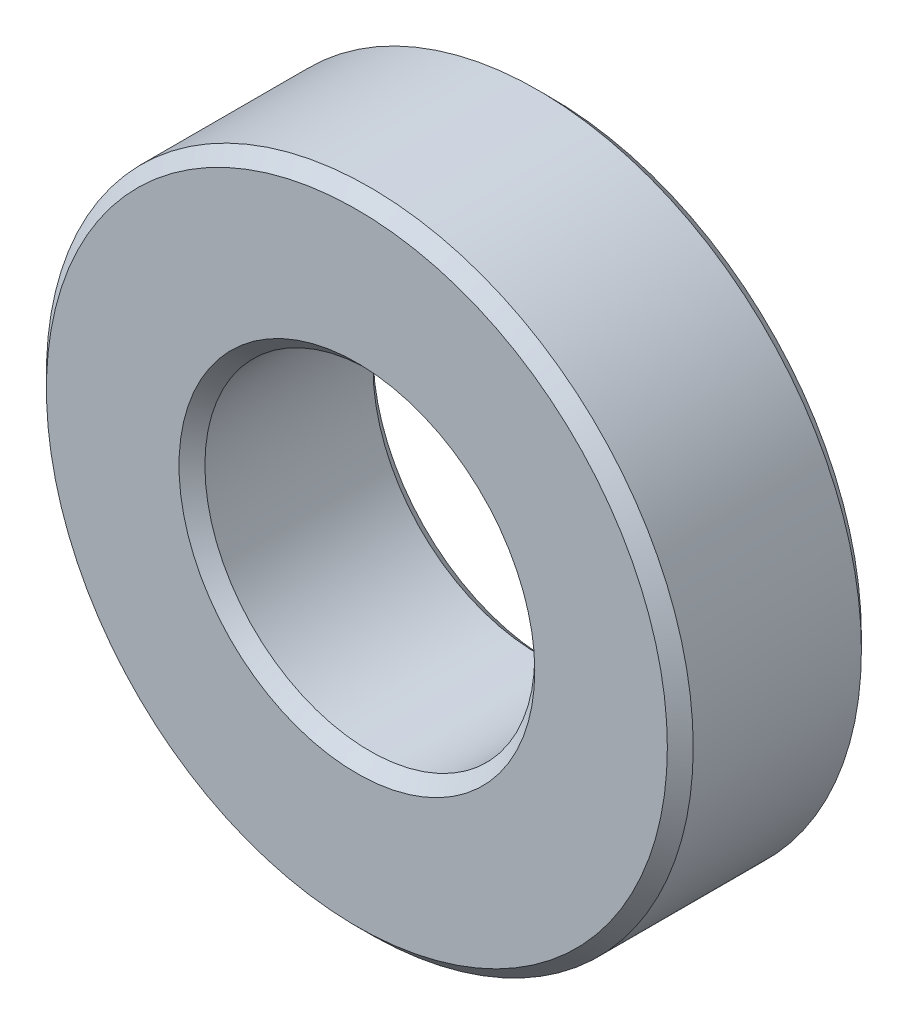
ISO-10303-21;
HEADER;
FILE_DESCRIPTION(('STEP AP214'),'2;1');
FILE_NAME('part.step','',(''),(''),'','','');
FILE_SCHEMA(('AUTOMOTIVE_DESIGN { 1 0 10303 214 1 1 1 1 }'));
ENDSEC;
DATA;
#1=APPLICATION_CONTEXT('core data for automotive mechanical design processes');
#2=APPLICATION_PROTOCOL_DEFINITION('international standard','automotive_design',2000,#1);
#3=PRODUCT_CONTEXT('',#1,'mechanical');
#4=PRODUCT('Part','Part','',(#3));
#5=PRODUCT_RELATED_PRODUCT_CATEGORY('part','',(#4));
#6=PRODUCT_DEFINITION_FORMATION('','',#4);
#7=PRODUCT_DEFINITION_CONTEXT('part definition',#1,'design');
#8=PRODUCT_DEFINITION('design','',#6,#7);
#9=PRODUCT_DEFINITION_SHAPE('','',#8);
#10=(LENGTH_UNIT() NAMED_UNIT(*) SI_UNIT(.MILLI.,.METRE.));
#11=(NAMED_UNIT(*) PLANE_ANGLE_UNIT() SI_UNIT($,.RADIAN.));
#12=(NAMED_UNIT(*) SI_UNIT($,.STERADIAN.) SOLID_ANGLE_UNIT());
#13=UNCERTAINTY_MEASURE_WITH_UNIT(LENGTH_MEASURE(1.E-05),#10,'distance_accuracy_value','');
#14=(GEOMETRIC_REPRESENTATION_CONTEXT(3) GLOBAL_UNCERTAINTY_ASSIGNED_CONTEXT((#13)) GLOBAL_UNIT_ASSIGNED_CONTEXT((#10,
#11,#12)) REPRESENTATION_CONTEXT('',''));
#15=CARTESIAN_POINT('',(0.,0.,0.));
#16=DIRECTION('',(0.,0.,1.));
#17=DIRECTION('',(1.,0.,0.));
#18=AXIS2_PLACEMENT_3D('',#15,#16,#17);
#19=CARTESIAN_POINT('',(0.,0.,3.));
#20=DIRECTION('',(0.,0.,1.));
#21=DIRECTION('',(1.,0.,0.));
#22=AXIS2_PLACEMENT_3D('',#19,#20,#21);
#23=PLANE('',#22);
#24=CARTESIAN_POINT('',(0.,0.,3.));
#25=DIRECTION('',(0.,0.,1.));
#26=DIRECTION('',(1.,0.,0.));
#27=AXIS2_PLACEMENT_3D('',#24,#25,#26);
#28=CIRCLE('',#27,2.75);
#29=CARTESIAN_POINT('',(2.75,0.,3.));
#30=VERTEX_POINT('',#29);
#31=EDGE_CURVE('E10',#30,#30,#28,.F.);
#32=ORIENTED_EDGE('',*,*,#31,.T.);
#33=EDGE_LOOP('',(#32));
#34=FACE_BOUND('',#33,.T.);
#35=CARTESIAN_POINT('',(0.,0.,3.));
#36=DIRECTION('',(0.,0.,1.));
#37=DIRECTION('',(1.,0.,0.));
#38=AXIS2_PLACEMENT_3D('',#35,#36,#37);
#39=CIRCLE('',#38,4.8);
#40=CARTESIAN_POINT('',(4.8,0.,3.));
#41=VERTEX_POINT('',#40);
#42=EDGE_CURVE('E41',#41,#41,#39,.T.);
#43=ORIENTED_EDGE('',*,*,#42,.T.);
#44=EDGE_LOOP('',(#43));
#45=FACE_BOUND('',#44,.T.);
#46=ADVANCED_FACE('F34',(#34,#45),#23,.T.);
#47=CARTESIAN_POINT('',(0.,0.,0.));
#48=DIRECTION('',(0.,0.,1.));
#49=DIRECTION('',(1.,0.,0.));
#50=AXIS2_PLACEMENT_3D('',#47,#48,#49);
#51=PLANE('',#50);
#52=CARTESIAN_POINT('',(0.,0.,0.));
#53=DIRECTION('',(0.,0.,1.));
#54=DIRECTION('',(1.,0.,0.));
#55=AXIS2_PLACEMENT_3D('',#52,#53,#54);
#56=CIRCLE('',#55,4.8);
#57=CARTESIAN_POINT('',(4.8,0.,0.));
#58=VERTEX_POINT('',#57);
#59=EDGE_CURVE('E54',#58,#58,#56,.F.);
#60=ORIENTED_EDGE('',*,*,#59,.T.);
#61=EDGE_LOOP('',(#60));
#62=FACE_BOUND('',#61,.T.);
#63=CARTESIAN_POINT('',(0.,0.,0.));
#64=DIRECTION('',(0.,0.,1.));
#65=DIRECTION('',(1.,0.,0.));
#66=AXIS2_PLACEMENT_3D('',#63,#64,#65);
#67=CIRCLE('',#66,2.75);
#68=CARTESIAN_POINT('',(2.75,0.,0.));
#69=VERTEX_POINT('',#68);
#70=EDGE_CURVE('E57',#69,#69,#67,.T.);
#71=ORIENTED_EDGE('',*,*,#70,.T.);
#72=EDGE_LOOP('',(#71));
#73=FACE_BOUND('',#72,.T.);
#74=ADVANCED_FACE('F78',(#62,#73),#51,.F.);
#75=CARTESIAN_POINT('',(0.,0.,3.));
#76=DIRECTION('',(0.,0.,-1.));
#77=DIRECTION('',(-1.,0.,0.));
#78=AXIS2_PLACEMENT_3D('',#75,#76,#77);
#79=CYLINDRICAL_SURFACE('',#78,5.);
#80=CARTESIAN_POINT('',(0.,0.,0.199999999999999));
#81=DIRECTION('',(0.,0.,1.));
#82=DIRECTION('',(1.,0.,0.));
#83=AXIS2_PLACEMENT_3D('',#80,#81,#82);
#84=CIRCLE('',#83,5.);
#85=CARTESIAN_POINT('',(5.,0.,0.199999999999999));
#86=VERTEX_POINT('',#85);
#87=EDGE_CURVE('E60',#86,#86,#84,.T.);
#88=ORIENTED_EDGE('',*,*,#87,.T.);
#89=EDGE_LOOP('',(#88));
#90=FACE_BOUND('',#89,.T.);
#91=CARTESIAN_POINT('',(0.,0.,2.8));
#92=DIRECTION('',(0.,0.,1.));
#93=DIRECTION('',(1.,0.,0.));
#94=AXIS2_PLACEMENT_3D('',#91,#92,#93);
#95=CIRCLE('',#94,5.);
#96=CARTESIAN_POINT('',(5.,0.,2.8));
#97=VERTEX_POINT('',#96);
#98=EDGE_CURVE('E63',#97,#97,#95,.F.);
#99=ORIENTED_EDGE('',*,*,#98,.T.);
#100=EDGE_LOOP('',(#99));
#101=FACE_BOUND('',#100,.T.);
#102=ADVANCED_FACE('F67',(#90,#101),#79,.T.);
#103=CARTESIAN_POINT('',(0.,0.,3.));
#104=DIRECTION('',(0.,0.,-1.));
#105=DIRECTION('',(-1.,0.,0.));
#106=AXIS2_PLACEMENT_3D('',#103,#104,#105);
#107=CYLINDRICAL_SURFACE('',#106,2.55);
#108=CARTESIAN_POINT('',(0.,0.,0.2));
#109=DIRECTION('',(0.,0.,1.));
#110=DIRECTION('',(1.,0.,0.));
#111=AXIS2_PLACEMENT_3D('',#108,#109,#110);
#112=CIRCLE('',#111,2.55);
#113=CARTESIAN_POINT('',(2.55,0.,0.2));
#114=VERTEX_POINT('',#113);
#115=EDGE_CURVE('E45',#114,#114,#112,.F.);
#116=ORIENTED_EDGE('',*,*,#115,.T.);
#117=EDGE_LOOP('',(#116));
#118=FACE_BOUND('',#117,.T.);
#119=CARTESIAN_POINT('',(0.,0.,2.8));
#120=DIRECTION('',(0.,0.,1.));
#121=DIRECTION('',(1.,0.,0.));
#122=AXIS2_PLACEMENT_3D('',#119,#120,#121);
#123=CIRCLE('',#122,2.55);
#124=CARTESIAN_POINT('',(2.55,0.,2.8));
#125=VERTEX_POINT('',#124);
#126=EDGE_CURVE('E49',#125,#125,#123,.T.);
#127=ORIENTED_EDGE('',*,*,#126,.T.);
#128=EDGE_LOOP('',(#127));
#129=FACE_BOUND('',#128,.T.);
#130=ADVANCED_FACE('F86',(#118,#129),#107,.F.);
#131=CARTESIAN_POINT('',(0.,0.,0.199999999999999));
#132=DIRECTION('',(0.,0.,1.));
#133=DIRECTION('',(1.,0.,0.));
#134=AXIS2_PLACEMENT_3D('',#131,#132,#133);
#135=CONICAL_SURFACE('',#134,5.,0.785398163397448);
#136=ORIENTED_EDGE('',*,*,#59,.F.);
#137=EDGE_LOOP('',(#136));
#138=FACE_BOUND('',#137,.T.);
#139=ORIENTED_EDGE('',*,*,#87,.F.);
#140=EDGE_LOOP('',(#139));
#141=FACE_BOUND('',#140,.T.);
#142=ADVANCED_FACE('F91',(#138,#141),#135,.T.);
#143=CARTESIAN_POINT('',(0.,0.,0.));
#144=DIRECTION('',(0.,0.,-1.));
#145=DIRECTION('',(-1.,0.,0.));
#146=AXIS2_PLACEMENT_3D('',#143,#144,#145);
#147=CONICAL_SURFACE('',#146,2.75,0.785398163397445);
#148=ORIENTED_EDGE('',*,*,#115,.F.);
#149=EDGE_LOOP('',(#148));
#150=FACE_BOUND('',#149,.T.);
#151=ORIENTED_EDGE('',*,*,#70,.F.);
#152=EDGE_LOOP('',(#151));
#153=FACE_BOUND('',#152,.T.);
#154=ADVANCED_FACE('F75',(#150,#153),#147,.F.);
#155=CARTESIAN_POINT('',(0.,0.,2.8));
#156=DIRECTION('',(0.,0.,1.));
#157=DIRECTION('',(1.,0.,0.));
#158=AXIS2_PLACEMENT_3D('',#155,#156,#157);
#159=CONICAL_SURFACE('',#158,2.55,0.785398163397449);
#160=ORIENTED_EDGE('',*,*,#31,.F.);
#161=EDGE_LOOP('',(#160));
#162=FACE_BOUND('',#161,.T.);
#163=ORIENTED_EDGE('',*,*,#126,.F.);
#164=EDGE_LOOP('',(#163));
#165=FACE_BOUND('',#164,.T.);
#166=ADVANCED_FACE('F71',(#162,#165),#159,.F.);
#167=CARTESIAN_POINT('',(0.,0.,3.));
#168=DIRECTION('',(0.,0.,-1.));
#169=DIRECTION('',(-1.,0.,0.));
#170=AXIS2_PLACEMENT_3D('',#167,#168,#169);
#171=CONICAL_SURFACE('',#170,4.8,0.785398163397446);
#172=ORIENTED_EDGE('',*,*,#98,.F.);
#173=EDGE_LOOP('',(#172));
#174=FACE_BOUND('',#173,.T.);
#175=ORIENTED_EDGE('',*,*,#42,.F.);
#176=EDGE_LOOP('',(#175));
#177=FACE_BOUND('',#176,.T.);
#178=ADVANCED_FACE('F36',(#174,#177),#171,.T.);
#179=CLOSED_SHELL('',(#46,#74,#102,#130,#142,#154,#166,#178));
#180=MANIFOLD_SOLID_BREP('B2',#179);
#181=ADVANCED_BREP_SHAPE_REPRESENTATION('',(#18,#180),#14);
#182=SHAPE_DEFINITION_REPRESENTATION(#9,#181);
ENDSEC;
END-ISO-10303-21;
